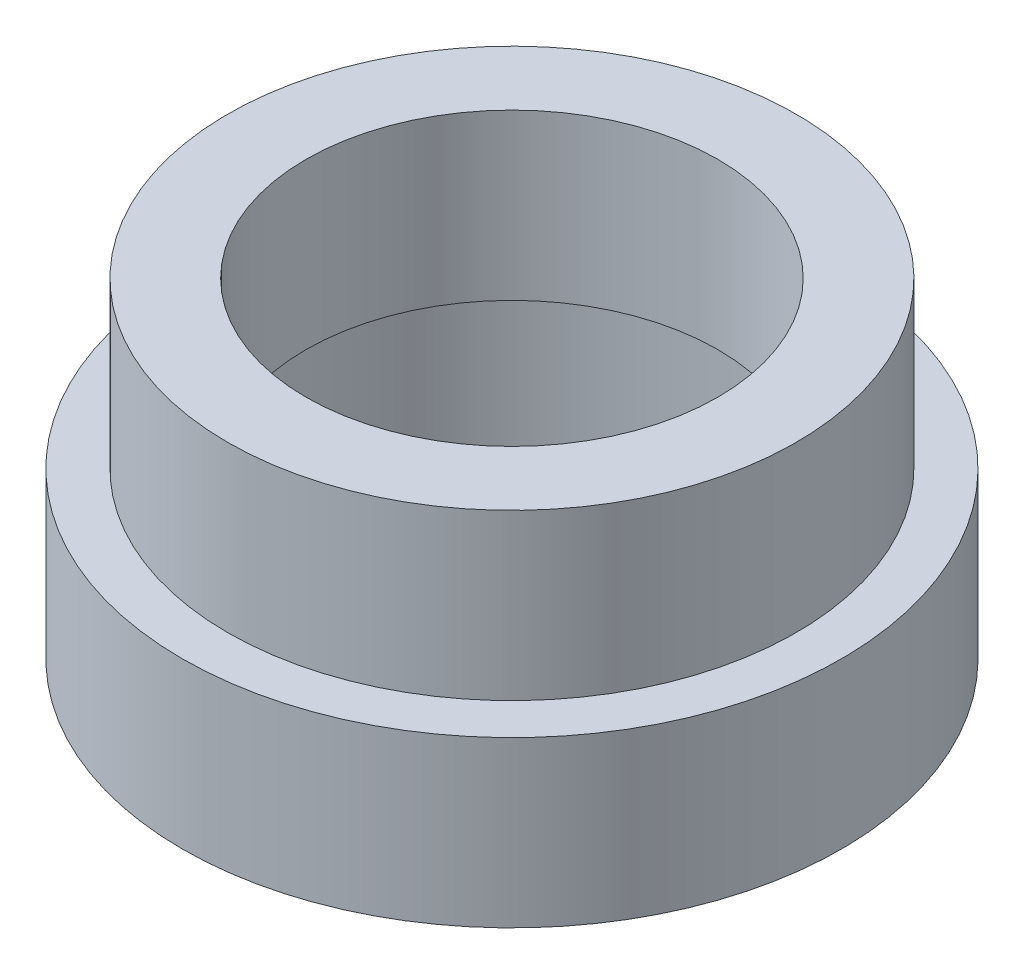
ISO-10303-21;
HEADER;
FILE_DESCRIPTION(('STEP AP214'),'2;1');
FILE_NAME('part.step','',(''),(''),'','','');
FILE_SCHEMA(('AUTOMOTIVE_DESIGN { 1 0 10303 214 1 1 1 1 }'));
ENDSEC;
DATA;
#1=APPLICATION_CONTEXT('core data for automotive mechanical design processes');
#2=APPLICATION_PROTOCOL_DEFINITION('international standard','automotive_design',2000,#1);
#3=PRODUCT_CONTEXT('',#1,'mechanical');
#4=PRODUCT('Part','Part','',(#3));
#5=PRODUCT_RELATED_PRODUCT_CATEGORY('part','',(#4));
#6=PRODUCT_DEFINITION_FORMATION('','',#4);
#7=PRODUCT_DEFINITION_CONTEXT('part definition',#1,'design');
#8=PRODUCT_DEFINITION('design','',#6,#7);
#9=PRODUCT_DEFINITION_SHAPE('','',#8);
#10=(LENGTH_UNIT() NAMED_UNIT(*) SI_UNIT(.MILLI.,.METRE.));
#11=(NAMED_UNIT(*) PLANE_ANGLE_UNIT() SI_UNIT($,.RADIAN.));
#12=(NAMED_UNIT(*) SI_UNIT($,.STERADIAN.) SOLID_ANGLE_UNIT());
#13=UNCERTAINTY_MEASURE_WITH_UNIT(LENGTH_MEASURE(1.E-05),#10,'distance_accuracy_value','');
#14=(GEOMETRIC_REPRESENTATION_CONTEXT(3) GLOBAL_UNCERTAINTY_ASSIGNED_CONTEXT((#13)) GLOBAL_UNIT_ASSIGNED_CONTEXT((#10,
#11,#12)) REPRESENTATION_CONTEXT('',''));
#15=CARTESIAN_POINT('',(0.,0.,0.));
#16=DIRECTION('',(0.,0.,1.));
#17=DIRECTION('',(1.,0.,0.));
#18=AXIS2_PLACEMENT_3D('',#15,#16,#17);
#19=CARTESIAN_POINT('',(0.,20.,0.));
#20=DIRECTION('',(0.,-1.,0.));
#21=DIRECTION('',(0.,0.,-1.));
#22=AXIS2_PLACEMENT_3D('',#19,#20,#21);
#23=CYLINDRICAL_SURFACE('',#22,15.);
#24=CARTESIAN_POINT('',(0.,0.,0.));
#25=DIRECTION('',(0.,1.,0.));
#26=DIRECTION('',(0.,0.,1.));
#27=AXIS2_PLACEMENT_3D('',#24,#25,#26);
#28=CIRCLE('',#27,15.);
#29=CARTESIAN_POINT('',(0.,0.,15.));
#30=VERTEX_POINT('',#29);
#31=EDGE_CURVE('E49',#30,#30,#28,.T.);
#32=ORIENTED_EDGE('',*,*,#31,.F.);
#33=EDGE_LOOP('',(#32));
#34=FACE_BOUND('',#33,.T.);
#35=CARTESIAN_POINT('',(0.,10.,0.));
#36=DIRECTION('',(0.,1.,0.));
#37=DIRECTION('',(0.,0.,1.));
#38=AXIS2_PLACEMENT_3D('',#35,#36,#37);
#39=CIRCLE('',#38,15.);
#40=CARTESIAN_POINT('',(0.,10.,15.));
#41=VERTEX_POINT('',#40);
#42=EDGE_CURVE('E66',#41,#41,#39,.T.);
#43=ORIENTED_EDGE('',*,*,#42,.T.);
#44=EDGE_LOOP('',(#43));
#45=FACE_BOUND('',#44,.T.);
#46=ADVANCED_FACE('F41',(#34,#45),#23,.F.);
#47=CARTESIAN_POINT('',(0.,20.,0.));
#48=DIRECTION('',(0.,1.,0.));
#49=DIRECTION('',(0.,0.,1.));
#50=AXIS2_PLACEMENT_3D('',#47,#48,#49);
#51=PLANE('',#50);
#52=CARTESIAN_POINT('',(0.,20.,0.));
#53=DIRECTION('',(0.,1.,0.));
#54=DIRECTION('',(0.,0.,1.));
#55=AXIS2_PLACEMENT_3D('',#52,#53,#54);
#56=CIRCLE('',#55,17.25);
#57=CARTESIAN_POINT('',(0.,20.,17.25));
#58=VERTEX_POINT('',#57);
#59=EDGE_CURVE('E10',#58,#58,#56,.T.);
#60=ORIENTED_EDGE('',*,*,#59,.T.);
#61=EDGE_LOOP('',(#60));
#62=FACE_BOUND('',#61,.T.);
#63=CARTESIAN_POINT('',(0.,20.,0.));
#64=DIRECTION('',(0.,1.,0.));
#65=DIRECTION('',(0.,0.,1.));
#66=AXIS2_PLACEMENT_3D('',#63,#64,#65);
#67=CIRCLE('',#66,12.5);
#68=CARTESIAN_POINT('',(0.,20.,12.5));
#69=VERTEX_POINT('',#68);
#70=EDGE_CURVE('E73',#69,#69,#67,.T.);
#71=ORIENTED_EDGE('',*,*,#70,.F.);
#72=EDGE_LOOP('',(#71));
#73=FACE_BOUND('',#72,.T.);
#74=ADVANCED_FACE('F85',(#62,#73),#51,.T.);
#75=CARTESIAN_POINT('',(0.,0.,0.));
#76=DIRECTION('',(0.,1.,0.));
#77=DIRECTION('',(0.,0.,1.));
#78=AXIS2_PLACEMENT_3D('',#75,#76,#77);
#79=PLANE('',#78);
#80=ORIENTED_EDGE('',*,*,#31,.T.);
#81=EDGE_LOOP('',(#80));
#82=FACE_BOUND('',#81,.T.);
#83=CARTESIAN_POINT('',(0.,0.,0.));
#84=DIRECTION('',(0.,1.,0.));
#85=DIRECTION('',(0.,0.,1.));
#86=AXIS2_PLACEMENT_3D('',#83,#84,#85);
#87=CIRCLE('',#86,20.);
#88=CARTESIAN_POINT('',(0.,0.,20.));
#89=VERTEX_POINT('',#88);
#90=EDGE_CURVE('E62',#89,#89,#87,.T.);
#91=ORIENTED_EDGE('',*,*,#90,.F.);
#92=EDGE_LOOP('',(#91));
#93=FACE_BOUND('',#92,.T.);
#94=ADVANCED_FACE('F87',(#82,#93),#79,.F.);
#95=CARTESIAN_POINT('',(0.,20.,0.));
#96=DIRECTION('',(0.,-1.,0.));
#97=DIRECTION('',(0.,0.,-1.));
#98=AXIS2_PLACEMENT_3D('',#95,#96,#97);
#99=CYLINDRICAL_SURFACE('',#98,17.25);
#100=CARTESIAN_POINT('',(0.,10.,0.));
#101=DIRECTION('',(0.,1.,0.));
#102=DIRECTION('',(0.,0.,1.));
#103=AXIS2_PLACEMENT_3D('',#100,#101,#102);
#104=CIRCLE('',#103,17.25);
#105=CARTESIAN_POINT('',(0.,10.,17.25));
#106=VERTEX_POINT('',#105);
#107=EDGE_CURVE('E54',#106,#106,#104,.T.);
#108=ORIENTED_EDGE('',*,*,#107,.T.);
#109=EDGE_LOOP('',(#108));
#110=FACE_BOUND('',#109,.T.);
#111=ORIENTED_EDGE('',*,*,#59,.F.);
#112=EDGE_LOOP('',(#111));
#113=FACE_BOUND('',#112,.T.);
#114=ADVANCED_FACE('F43',(#110,#113),#99,.T.);
#115=CARTESIAN_POINT('',(0.,10.,0.));
#116=DIRECTION('',(0.,1.,0.));
#117=DIRECTION('',(0.,0.,1.));
#118=AXIS2_PLACEMENT_3D('',#115,#116,#117);
#119=PLANE('',#118);
#120=CARTESIAN_POINT('',(0.,10.,0.));
#121=DIRECTION('',(0.,1.,0.));
#122=DIRECTION('',(0.,0.,1.));
#123=AXIS2_PLACEMENT_3D('',#120,#121,#122);
#124=CIRCLE('',#123,20.);
#125=CARTESIAN_POINT('',(0.,10.,20.));
#126=VERTEX_POINT('',#125);
#127=EDGE_CURVE('E59',#126,#126,#124,.T.);
#128=ORIENTED_EDGE('',*,*,#127,.T.);
#129=EDGE_LOOP('',(#128));
#130=FACE_BOUND('',#129,.T.);
#131=ORIENTED_EDGE('',*,*,#107,.F.);
#132=EDGE_LOOP('',(#131));
#133=FACE_BOUND('',#132,.T.);
#134=ADVANCED_FACE('F100',(#130,#133),#119,.T.);
#135=CARTESIAN_POINT('',(0.,10.,0.));
#136=DIRECTION('',(0.,-1.,0.));
#137=DIRECTION('',(0.,0.,-1.));
#138=AXIS2_PLACEMENT_3D('',#135,#136,#137);
#139=CYLINDRICAL_SURFACE('',#138,20.);
#140=ORIENTED_EDGE('',*,*,#127,.F.);
#141=EDGE_LOOP('',(#140));
#142=FACE_BOUND('',#141,.T.);
#143=ORIENTED_EDGE('',*,*,#90,.T.);
#144=EDGE_LOOP('',(#143));
#145=FACE_BOUND('',#144,.T.);
#146=ADVANCED_FACE('F96',(#142,#145),#139,.T.);
#147=CARTESIAN_POINT('',(0.,10.,0.));
#148=DIRECTION('',(0.,1.,0.));
#149=DIRECTION('',(0.,0.,1.));
#150=AXIS2_PLACEMENT_3D('',#147,#148,#149);
#151=PLANE('',#150);
#152=ORIENTED_EDGE('',*,*,#42,.F.);
#153=EDGE_LOOP('',(#152));
#154=FACE_BOUND('',#153,.T.);
#155=CARTESIAN_POINT('',(0.,10.,0.));
#156=DIRECTION('',(0.,1.,0.));
#157=DIRECTION('',(0.,0.,1.));
#158=AXIS2_PLACEMENT_3D('',#155,#156,#157);
#159=CIRCLE('',#158,12.5);
#160=CARTESIAN_POINT('',(0.,10.,12.5));
#161=VERTEX_POINT('',#160);
#162=EDGE_CURVE('E74',#161,#161,#159,.T.);
#163=ORIENTED_EDGE('',*,*,#162,.T.);
#164=EDGE_LOOP('',(#163));
#165=FACE_BOUND('',#164,.T.);
#166=ADVANCED_FACE('F99',(#154,#165),#151,.F.);
#167=CARTESIAN_POINT('',(0.,20.,0.));
#168=DIRECTION('',(0.,-1.,0.));
#169=DIRECTION('',(0.,0.,-1.));
#170=AXIS2_PLACEMENT_3D('',#167,#168,#169);
#171=CYLINDRICAL_SURFACE('',#170,12.5);
#172=ORIENTED_EDGE('',*,*,#70,.T.);
#173=EDGE_LOOP('',(#172));
#174=FACE_BOUND('',#173,.T.);
#175=ORIENTED_EDGE('',*,*,#162,.F.);
#176=EDGE_LOOP('',(#175));
#177=FACE_BOUND('',#176,.T.);
#178=ADVANCED_FACE('F82',(#174,#177),#171,.F.);
#179=CLOSED_SHELL('',(#46,#74,#94,#114,#134,#146,#166,#178));
#180=MANIFOLD_SOLID_BREP('B2',#179);
#181=ADVANCED_BREP_SHAPE_REPRESENTATION('',(#18,#180),#14);
#182=SHAPE_DEFINITION_REPRESENTATION(#9,#181);
ENDSEC;
END-ISO-10303-21;
